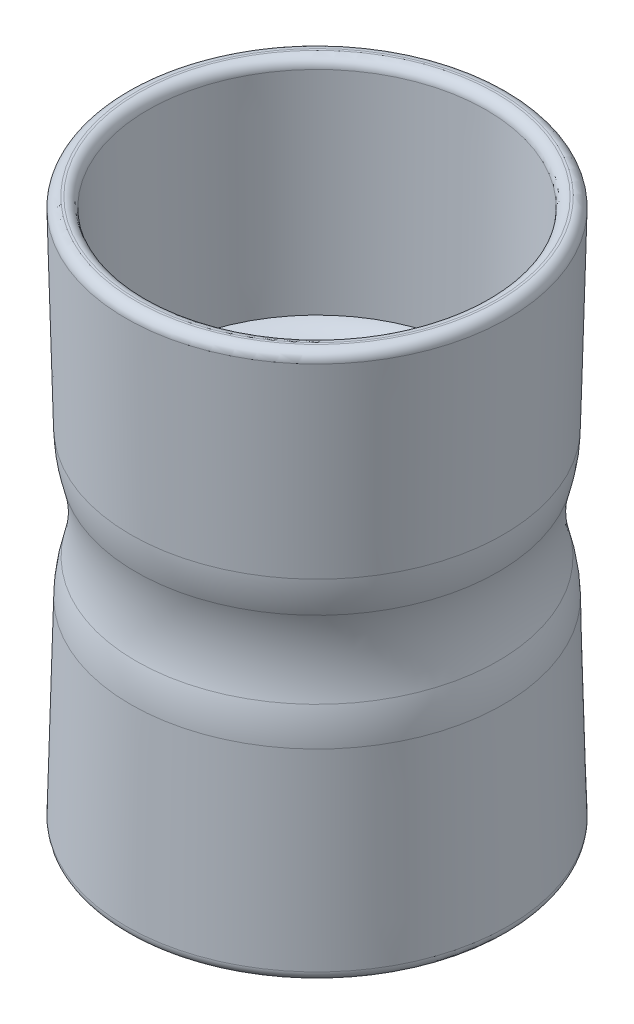
ISO-10303-21;
HEADER;
FILE_DESCRIPTION(('STEP AP214'),'2;1');
FILE_NAME('part.step','',(''),(''),'','','');
FILE_SCHEMA(('AUTOMOTIVE_DESIGN { 1 0 10303 214 1 1 1 1 }'));
ENDSEC;
DATA;
#1=APPLICATION_CONTEXT('core data for automotive mechanical design processes');
#2=APPLICATION_PROTOCOL_DEFINITION('international standard','automotive_design',2000,#1);
#3=PRODUCT_CONTEXT('',#1,'mechanical');
#4=PRODUCT('Part','Part','',(#3));
#5=PRODUCT_RELATED_PRODUCT_CATEGORY('part','',(#4));
#6=PRODUCT_DEFINITION_FORMATION('','',#4);
#7=PRODUCT_DEFINITION_CONTEXT('part definition',#1,'design');
#8=PRODUCT_DEFINITION('design','',#6,#7);
#9=PRODUCT_DEFINITION_SHAPE('','',#8);
#10=(LENGTH_UNIT() NAMED_UNIT(*) SI_UNIT(.MILLI.,.METRE.));
#11=(NAMED_UNIT(*) PLANE_ANGLE_UNIT() SI_UNIT($,.RADIAN.));
#12=(NAMED_UNIT(*) SI_UNIT($,.STERADIAN.) SOLID_ANGLE_UNIT());
#13=UNCERTAINTY_MEASURE_WITH_UNIT(LENGTH_MEASURE(1.E-05),#10,'distance_accuracy_value','');
#14=(GEOMETRIC_REPRESENTATION_CONTEXT(3) GLOBAL_UNCERTAINTY_ASSIGNED_CONTEXT((#13)) GLOBAL_UNIT_ASSIGNED_CONTEXT((#10,
#11,#12)) REPRESENTATION_CONTEXT('',''));
#15=CARTESIAN_POINT('',(0.,0.,0.));
#16=DIRECTION('',(0.,0.,1.));
#17=DIRECTION('',(1.,0.,0.));
#18=AXIS2_PLACEMENT_3D('',#15,#16,#17);
#19=CARTESIAN_POINT('',(0.,-35.4584538375974,0.));
#20=DIRECTION('',(0.,-1.,0.));
#21=DIRECTION('',(0.,0.,-1.));
#22=AXIS2_PLACEMENT_3D('',#19,#20,#21);
#23=PLANE('',#22);
#24=CARTESIAN_POINT('',(0.,-35.4584538375974,0.));
#25=DIRECTION('',(0.,-1.,0.));
#26=DIRECTION('',(0.,0.,-1.));
#27=AXIS2_PLACEMENT_3D('',#24,#25,#26);
#28=CIRCLE('',#27,16.3777812060684);
#29=CARTESIAN_POINT('',(0.,-35.4584538375974,-16.3777812060684));
#30=VERTEX_POINT('',#29);
#31=EDGE_CURVE('E40',#30,#30,#28,.F.);
#32=ORIENTED_EDGE('',*,*,#31,.T.);
#33=EDGE_LOOP('',(#32));
#34=FACE_BOUND('',#33,.T.);
#35=CARTESIAN_POINT('',(0.,-35.4584538375974,0.));
#36=DIRECTION('',(0.,-1.,0.));
#37=DIRECTION('',(0.,0.,-1.));
#38=AXIS2_PLACEMENT_3D('',#35,#36,#37);
#39=CIRCLE('',#38,16.5772187939316);
#40=CARTESIAN_POINT('',(0.,-35.4584538375974,-16.5772187939316));
#41=VERTEX_POINT('',#40);
#42=EDGE_CURVE('E44',#41,#41,#39,.T.);
#43=ORIENTED_EDGE('',*,*,#42,.T.);
#44=EDGE_LOOP('',(#43));
#45=FACE_BOUND('',#44,.T.);
#46=ADVANCED_FACE('F33',(#34,#45),#23,.T.);
#47=CARTESIAN_POINT('',(0.,-35.4584538375974,0.));
#48=DIRECTION('',(0.,-1.,0.));
#49=DIRECTION('',(0.,0.,-1.));
#50=AXIS2_PLACEMENT_3D('',#47,#48,#49);
#51=CONICAL_SURFACE('',#50,17.5,0.0249947936189202);
#52=CARTESIAN_POINT('',(0.,-34.5359608655531,0.));
#53=DIRECTION('',(0.,1.,0.));
#54=DIRECTION('',(0.,0.,1.));
#55=AXIS2_PLACEMENT_3D('',#52,#53,#54);
#56=CIRCLE('',#55,17.4769376756989);
#57=CARTESIAN_POINT('',(0.,-34.5359608655531,17.4769376756989));
#58=VERTEX_POINT('',#57);
#59=EDGE_CURVE('E10',#58,#58,#56,.T.);
#60=ORIENTED_EDGE('',*,*,#59,.T.);
#61=EDGE_LOOP('',(#60));
#62=FACE_BOUND('',#61,.T.);
#63=CARTESIAN_POINT('',(0.,-17.1863836520823,0.));
#64=DIRECTION('',(0.,-1.,0.));
#65=DIRECTION('',(0.,0.,-1.));
#66=AXIS2_PLACEMENT_3D('',#63,#64,#65);
#67=CIRCLE('',#66,17.0431982453621);
#68=CARTESIAN_POINT('',(0.,-17.1863836520823,-17.0431982453621));
#69=VERTEX_POINT('',#68);
#70=EDGE_CURVE('E80',#69,#69,#67,.T.);
#71=ORIENTED_EDGE('',*,*,#70,.T.);
#72=EDGE_LOOP('',(#71));
#73=FACE_BOUND('',#72,.T.);
#74=ADVANCED_FACE('F110',(#62,#73),#51,.T.);
#75=CARTESIAN_POINT('',(0.,14.5415461624026,0.));
#76=DIRECTION('',(0.,1.,0.));
#77=DIRECTION('',(0.,0.,1.));
#78=AXIS2_PLACEMENT_3D('',#75,#76,#77);
#79=CONICAL_SURFACE('',#78,17.5,0.0249947936189202);
#80=CARTESIAN_POINT('',(0.,13.6190531903585,0.));
#81=DIRECTION('',(0.,-1.,0.));
#82=DIRECTION('',(0.,0.,-1.));
#83=AXIS2_PLACEMENT_3D('',#80,#81,#82);
#84=CIRCLE('',#83,17.4769376756989);
#85=CARTESIAN_POINT('',(0.,13.6190531903585,-17.4769376756989));
#86=VERTEX_POINT('',#85);
#87=EDGE_CURVE('E53',#86,#86,#84,.T.);
#88=ORIENTED_EDGE('',*,*,#87,.T.);
#89=EDGE_LOOP('',(#88));
#90=FACE_BOUND('',#89,.T.);
#91=CARTESIAN_POINT('',(0.,-3.73052402311314,0.));
#92=DIRECTION('',(0.,-1.,0.));
#93=DIRECTION('',(0.,0.,-1.));
#94=AXIS2_PLACEMENT_3D('',#91,#92,#93);
#95=CIRCLE('',#94,17.0431982453621);
#96=CARTESIAN_POINT('',(0.,-3.73052402311314,-17.0431982453621));
#97=VERTEX_POINT('',#96);
#98=EDGE_CURVE('E71',#97,#97,#95,.F.);
#99=ORIENTED_EDGE('',*,*,#98,.T.);
#100=EDGE_LOOP('',(#99));
#101=FACE_BOUND('',#100,.T.);
#102=ADVANCED_FACE('F115',(#90,#101),#79,.T.);
#103=CARTESIAN_POINT('',(0.,14.5415461624026,0.));
#104=DIRECTION('',(0.,-1.,0.));
#105=DIRECTION('',(0.,0.,-1.));
#106=AXIS2_PLACEMENT_3D('',#103,#104,#105);
#107=PLANE('',#106);
#108=CARTESIAN_POINT('',(0.,14.5415461624026,0.));
#109=DIRECTION('',(0.,-1.,0.));
#110=DIRECTION('',(0.,0.,-1.));
#111=AXIS2_PLACEMENT_3D('',#108,#109,#110);
#112=CIRCLE('',#111,16.3777812060684);
#113=CARTESIAN_POINT('',(0.,14.5415461624026,-16.3777812060684));
#114=VERTEX_POINT('',#113);
#115=EDGE_CURVE('E59',#114,#114,#112,.T.);
#116=ORIENTED_EDGE('',*,*,#115,.T.);
#117=EDGE_LOOP('',(#116));
#118=FACE_BOUND('',#117,.T.);
#119=CARTESIAN_POINT('',(0.,14.5415461624026,0.));
#120=DIRECTION('',(0.,-1.,0.));
#121=DIRECTION('',(0.,0.,-1.));
#122=AXIS2_PLACEMENT_3D('',#119,#120,#121);
#123=CIRCLE('',#122,16.5772187939316);
#124=CARTESIAN_POINT('',(0.,14.5415461624026,-16.5772187939316));
#125=VERTEX_POINT('',#124);
#126=EDGE_CURVE('E62',#125,#125,#123,.F.);
#127=ORIENTED_EDGE('',*,*,#126,.T.);
#128=EDGE_LOOP('',(#127));
#129=FACE_BOUND('',#128,.T.);
#130=ADVANCED_FACE('F185',(#118,#129),#107,.F.);
#131=CARTESIAN_POINT('',(0.,-5.45845383759735,0.));
#132=DIRECTION('',(0.,1.,0.));
#133=DIRECTION('',(0.,0.,1.));
#134=AXIS2_PLACEMENT_3D('',#131,#132,#133);
#135=CONICAL_SURFACE('',#134,15.,0.0249947936189179);
#136=CARTESIAN_POINT('',(0.,13.6640391344468,0.));
#137=DIRECTION('',(0.,-1.,0.));
#138=DIRECTION('',(0.,0.,-1.));
#139=AXIS2_PLACEMENT_3D('',#136,#137,#138);
#140=CIRCLE('',#139,15.4780623243011);
#141=CARTESIAN_POINT('',(0.,13.6640391344468,-15.4780623243011));
#142=VERTEX_POINT('',#141);
#143=EDGE_CURVE('E56',#142,#142,#140,.F.);
#144=ORIENTED_EDGE('',*,*,#143,.T.);
#145=EDGE_LOOP('',(#144));
#146=FACE_BOUND('',#145,.T.);
#147=CARTESIAN_POINT('',(0.,-5.45845383759735,0.));
#148=DIRECTION('',(0.,-1.,0.));
#149=DIRECTION('',(0.,0.,-1.));
#150=AXIS2_PLACEMENT_3D('',#147,#148,#149);
#151=CIRCLE('',#150,15.);
#152=CARTESIAN_POINT('',(0.,-5.45845383759735,-15.));
#153=VERTEX_POINT('',#152);
#154=EDGE_CURVE('E83',#153,#153,#151,.T.);
#155=ORIENTED_EDGE('',*,*,#154,.T.);
#156=EDGE_LOOP('',(#155));
#157=FACE_BOUND('',#156,.T.);
#158=ADVANCED_FACE('F106',(#146,#157),#135,.F.);
#159=CARTESIAN_POINT('',(0.,-46.7154201481695,0.));
#160=DIRECTION('',(0.,-1.,0.));
#161=DIRECTION('',(0.,0.,-1.));
#162=AXIS2_PLACEMENT_3D('',#159,#160,#161);
#163=CYLINDRICAL_SURFACE('',#162,12.);
#164=CARTESIAN_POINT('',(0.,-12.4584538375974,0.));
#165=DIRECTION('',(0.,1.,0.));
#166=DIRECTION('',(0.,0.,1.));
#167=AXIS2_PLACEMENT_3D('',#164,#165,#166);
#168=CIRCLE('',#167,12.);
#169=CARTESIAN_POINT('',(0.,-12.4584538375974,12.));
#170=VERTEX_POINT('',#169);
#171=EDGE_CURVE('E65',#170,#170,#168,.F.);
#172=ORIENTED_EDGE('',*,*,#171,.T.);
#173=EDGE_LOOP('',(#172));
#174=FACE_BOUND('',#173,.T.);
#175=CARTESIAN_POINT('',(0.,-8.45845383759735,0.));
#176=DIRECTION('',(0.,1.,0.));
#177=DIRECTION('',(0.,0.,1.));
#178=AXIS2_PLACEMENT_3D('',#175,#176,#177);
#179=CIRCLE('',#178,12.);
#180=CARTESIAN_POINT('',(0.,-8.45845383759735,12.));
#181=VERTEX_POINT('',#180);
#182=EDGE_CURVE('E68',#181,#181,#179,.T.);
#183=ORIENTED_EDGE('',*,*,#182,.T.);
#184=EDGE_LOOP('',(#183));
#185=FACE_BOUND('',#184,.T.);
#186=ADVANCED_FACE('F96',(#174,#185),#163,.F.);
#187=CARTESIAN_POINT('',(0.,-15.4584538375974,0.));
#188=DIRECTION('',(0.,-1.,0.));
#189=DIRECTION('',(0.,0.,-1.));
#190=AXIS2_PLACEMENT_3D('',#187,#188,#189);
#191=CONICAL_SURFACE('',#190,15.,0.0249947936189179);
#192=CARTESIAN_POINT('',(0.,-34.5809468096415,0.));
#193=DIRECTION('',(0.,1.,0.));
#194=DIRECTION('',(0.,0.,1.));
#195=AXIS2_PLACEMENT_3D('',#192,#193,#194);
#196=CIRCLE('',#195,15.4780623243011);
#197=CARTESIAN_POINT('',(0.,-34.5809468096415,15.4780623243011));
#198=VERTEX_POINT('',#197);
#199=EDGE_CURVE('E48',#198,#198,#196,.F.);
#200=ORIENTED_EDGE('',*,*,#199,.T.);
#201=EDGE_LOOP('',(#200));
#202=FACE_BOUND('',#201,.T.);
#203=CARTESIAN_POINT('',(0.,-15.4584538375974,0.));
#204=DIRECTION('',(0.,-1.,0.));
#205=DIRECTION('',(0.,0.,-1.));
#206=AXIS2_PLACEMENT_3D('',#203,#204,#205);
#207=CIRCLE('',#206,15.);
#208=CARTESIAN_POINT('',(0.,-15.4584538375974,-15.));
#209=VERTEX_POINT('',#208);
#210=EDGE_CURVE('E86',#209,#209,#207,.T.);
#211=ORIENTED_EDGE('',*,*,#210,.F.);
#212=EDGE_LOOP('',(#211));
#213=FACE_BOUND('',#212,.T.);
#214=ADVANCED_FACE('F93',(#202,#213),#191,.F.);
#215=CARTESIAN_POINT('',(0.,-10.4584538375974,0.));
#216=DIRECTION('',(0.,-1.,0.));
#217=DIRECTION('',(0.,0.,-1.));
#218=AXIS2_PLACEMENT_3D('',#215,#216,#217);
#219=TOROIDAL_SURFACE('',#218,29.0723984615837,13.);
#220=CARTESIAN_POINT('',(0.,-13.9848679873812,0.));
#221=DIRECTION('',(0.,1.,0.));
#222=DIRECTION('',(0.,0.,1.));
#223=AXIS2_PLACEMENT_3D('',#220,#221,#222);
#224=CIRCLE('',#223,16.5598286518202);
#225=CARTESIAN_POINT('',(0.,-13.9848679873812,16.5598286518202));
#226=VERTEX_POINT('',#225);
#227=EDGE_CURVE('E74',#226,#226,#224,.T.);
#228=ORIENTED_EDGE('',*,*,#227,.T.);
#229=EDGE_LOOP('',(#228));
#230=FACE_BOUND('',#229,.T.);
#231=CARTESIAN_POINT('',(0.,-6.93203968781398,0.));
#232=DIRECTION('',(0.,-1.,0.));
#233=DIRECTION('',(0.,0.,-1.));
#234=AXIS2_PLACEMENT_3D('',#231,#232,#233);
#235=CIRCLE('',#234,16.5598286518201);
#236=CARTESIAN_POINT('',(0.,-6.93203968781398,-16.5598286518201));
#237=VERTEX_POINT('',#236);
#238=EDGE_CURVE('E77',#237,#237,#235,.T.);
#239=ORIENTED_EDGE('',*,*,#238,.T.);
#240=EDGE_LOOP('',(#239));
#241=FACE_BOUND('',#240,.T.);
#242=ADVANCED_FACE('F95',(#230,#241),#219,.F.);
#243=CARTESIAN_POINT('',(0.,-17.511282137165,0.));
#244=DIRECTION('',(0.,1.,0.));
#245=DIRECTION('',(0.,0.,1.));
#246=AXIS2_PLACEMENT_3D('',#243,#244,#245);
#247=DEGENERATE_TOROIDAL_SURFACE('',#246,4.04725884205663,13.,.T.);
#248=ORIENTED_EDGE('',*,*,#227,.F.);
#249=EDGE_LOOP('',(#248));
#250=FACE_BOUND('',#249,.T.);
#251=ORIENTED_EDGE('',*,*,#70,.F.);
#252=EDGE_LOOP('',(#251));
#253=FACE_BOUND('',#252,.T.);
#254=ADVANCED_FACE('F103',(#250,#253),#247,.T.);
#255=CARTESIAN_POINT('',(0.,-3.40562553803059,0.));
#256=DIRECTION('',(0.,1.,0.));
#257=DIRECTION('',(0.,0.,1.));
#258=AXIS2_PLACEMENT_3D('',#255,#256,#257);
#259=DEGENERATE_TOROIDAL_SURFACE('',#258,4.04725884205651,13.,.T.);
#260=ORIENTED_EDGE('',*,*,#98,.F.);
#261=EDGE_LOOP('',(#260));
#262=FACE_BOUND('',#261,.T.);
#263=ORIENTED_EDGE('',*,*,#238,.F.);
#264=EDGE_LOOP('',(#263));
#265=FACE_BOUND('',#264,.T.);
#266=ADVANCED_FACE('F122',(#262,#265),#259,.T.);
#267=CARTESIAN_POINT('',(0.,-12.4584538375974,0.));
#268=DIRECTION('',(0.,1.,0.));
#269=DIRECTION('',(0.,0.,1.));
#270=AXIS2_PLACEMENT_3D('',#267,#268,#269);
#271=TOROIDAL_SURFACE('',#270,15.,3.);
#272=ORIENTED_EDGE('',*,*,#210,.T.);
#273=EDGE_LOOP('',(#272));
#274=FACE_BOUND('',#273,.T.);
#275=ORIENTED_EDGE('',*,*,#171,.F.);
#276=EDGE_LOOP('',(#275));
#277=FACE_BOUND('',#276,.T.);
#278=ADVANCED_FACE('F90',(#274,#277),#271,.T.);
#279=CARTESIAN_POINT('',(0.,-8.45845383759735,0.));
#280=DIRECTION('',(0.,1.,0.));
#281=DIRECTION('',(0.,0.,1.));
#282=AXIS2_PLACEMENT_3D('',#279,#280,#281);
#283=TOROIDAL_SURFACE('',#282,15.,3.);
#284=ORIENTED_EDGE('',*,*,#182,.F.);
#285=EDGE_LOOP('',(#284));
#286=FACE_BOUND('',#285,.T.);
#287=ORIENTED_EDGE('',*,*,#154,.F.);
#288=EDGE_LOOP('',(#287));
#289=FACE_BOUND('',#288,.T.);
#290=ADVANCED_FACE('F129',(#286,#289),#283,.T.);
#291=CARTESIAN_POINT('',(0.,13.6415461624026,0.));
#292=DIRECTION('',(0.,-1.,0.));
#293=DIRECTION('',(0.,0.,-1.));
#294=AXIS2_PLACEMENT_3D('',#291,#292,#293);
#295=TOROIDAL_SURFACE('',#294,16.3777812060684,0.9);
#296=ORIENTED_EDGE('',*,*,#143,.F.);
#297=EDGE_LOOP('',(#296));
#298=FACE_BOUND('',#297,.T.);
#299=ORIENTED_EDGE('',*,*,#115,.F.);
#300=EDGE_LOOP('',(#299));
#301=FACE_BOUND('',#300,.T.);
#302=ADVANCED_FACE('F132',(#298,#301),#295,.T.);
#303=CARTESIAN_POINT('',(0.,13.6415461624026,0.));
#304=DIRECTION('',(0.,-1.,0.));
#305=DIRECTION('',(0.,0.,-1.));
#306=AXIS2_PLACEMENT_3D('',#303,#304,#305);
#307=TOROIDAL_SURFACE('',#306,16.5772187939316,0.9);
#308=ORIENTED_EDGE('',*,*,#126,.F.);
#309=EDGE_LOOP('',(#308));
#310=FACE_BOUND('',#309,.T.);
#311=ORIENTED_EDGE('',*,*,#87,.F.);
#312=EDGE_LOOP('',(#311));
#313=FACE_BOUND('',#312,.T.);
#314=ADVANCED_FACE('F136',(#310,#313),#307,.T.);
#315=CARTESIAN_POINT('',(0.,-34.5584538375974,0.));
#316=DIRECTION('',(0.,-1.,0.));
#317=DIRECTION('',(0.,0.,-1.));
#318=AXIS2_PLACEMENT_3D('',#315,#316,#317);
#319=TOROIDAL_SURFACE('',#318,16.3777812060684,0.9);
#320=ORIENTED_EDGE('',*,*,#31,.F.);
#321=EDGE_LOOP('',(#320));
#322=FACE_BOUND('',#321,.T.);
#323=ORIENTED_EDGE('',*,*,#199,.F.);
#324=EDGE_LOOP('',(#323));
#325=FACE_BOUND('',#324,.T.);
#326=ADVANCED_FACE('F139',(#322,#325),#319,.T.);
#327=CARTESIAN_POINT('',(0.,-34.5584538375974,0.));
#328=DIRECTION('',(0.,-1.,0.));
#329=DIRECTION('',(0.,0.,-1.));
#330=AXIS2_PLACEMENT_3D('',#327,#328,#329);
#331=TOROIDAL_SURFACE('',#330,16.5772187939316,0.9);
#332=ORIENTED_EDGE('',*,*,#59,.F.);
#333=EDGE_LOOP('',(#332));
#334=FACE_BOUND('',#333,.T.);
#335=ORIENTED_EDGE('',*,*,#42,.F.);
#336=EDGE_LOOP('',(#335));
#337=FACE_BOUND('',#336,.T.);
#338=ADVANCED_FACE('F35',(#334,#337),#331,.T.);
#339=CLOSED_SHELL('',(#46,#74,#102,#130,#158,#186,#214,#242,#254,#266,#278,#290,#302,#314,#326,#338));
#340=MANIFOLD_SOLID_BREP('B2',#339);
#341=ADVANCED_BREP_SHAPE_REPRESENTATION('',(#18,#340),#14);
#342=SHAPE_DEFINITION_REPRESENTATION(#9,#341);
ENDSEC;
END-ISO-10303-21;
